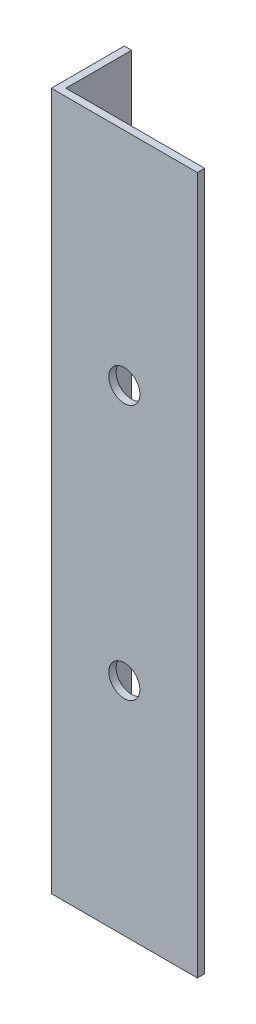
ISO-10303-21;
HEADER;
FILE_DESCRIPTION(('STEP AP214'),'2;1');
FILE_NAME('part.step','',(''),(''),'','','');
FILE_SCHEMA(('AUTOMOTIVE_DESIGN { 1 0 10303 214 1 1 1 1 }'));
ENDSEC;
DATA;
#1=APPLICATION_CONTEXT('core data for automotive mechanical design processes');
#2=APPLICATION_PROTOCOL_DEFINITION('international standard','automotive_design',2000,#1);
#3=PRODUCT_CONTEXT('',#1,'mechanical');
#4=PRODUCT('Part','Part','',(#3));
#5=PRODUCT_RELATED_PRODUCT_CATEGORY('part','',(#4));
#6=PRODUCT_DEFINITION_FORMATION('','',#4);
#7=PRODUCT_DEFINITION_CONTEXT('part definition',#1,'design');
#8=PRODUCT_DEFINITION('design','',#6,#7);
#9=PRODUCT_DEFINITION_SHAPE('','',#8);
#10=(LENGTH_UNIT() NAMED_UNIT(*) SI_UNIT(.MILLI.,.METRE.));
#11=(NAMED_UNIT(*) PLANE_ANGLE_UNIT() SI_UNIT($,.RADIAN.));
#12=(NAMED_UNIT(*) SI_UNIT($,.STERADIAN.) SOLID_ANGLE_UNIT());
#13=UNCERTAINTY_MEASURE_WITH_UNIT(LENGTH_MEASURE(1.E-05),#10,'distance_accuracy_value','');
#14=(GEOMETRIC_REPRESENTATION_CONTEXT(3) GLOBAL_UNCERTAINTY_ASSIGNED_CONTEXT((#13)) GLOBAL_UNIT_ASSIGNED_CONTEXT((#10,
#11,#12)) REPRESENTATION_CONTEXT('',''));
#15=CARTESIAN_POINT('',(0.,0.,0.));
#16=DIRECTION('',(0.,0.,1.));
#17=DIRECTION('',(1.,0.,0.));
#18=AXIS2_PLACEMENT_3D('',#15,#16,#17);
#19=CARTESIAN_POINT('',(40.,191.,0.));
#20=DIRECTION('',(0.,0.,-1.));
#21=DIRECTION('',(-1.,0.,0.));
#22=AXIS2_PLACEMENT_3D('',#19,#20,#21);
#23=PLANE('',#22);
#24=CARTESIAN_POINT('',(20.,60.5,0.));
#25=DIRECTION('',(0.,0.,1.));
#26=DIRECTION('',(1.,0.,0.));
#27=AXIS2_PLACEMENT_3D('',#24,#25,#26);
#28=CIRCLE('',#27,4.25000000000001);
#29=CARTESIAN_POINT('',(24.25,60.5,0.));
#30=VERTEX_POINT('',#29);
#31=EDGE_CURVE('E148',#30,#30,#28,.T.);
#32=ORIENTED_EDGE('',*,*,#31,.F.);
#33=EDGE_LOOP('',(#32));
#34=FACE_BOUND('',#33,.T.);
#35=CARTESIAN_POINT('',(20.,130.5,0.));
#36=DIRECTION('',(0.,0.,1.));
#37=DIRECTION('',(1.,0.,0.));
#38=AXIS2_PLACEMENT_3D('',#35,#36,#37);
#39=CIRCLE('',#38,4.25000000000001);
#40=CARTESIAN_POINT('',(24.25,130.5,0.));
#41=VERTEX_POINT('',#40);
#42=EDGE_CURVE('E140',#41,#41,#39,.T.);
#43=ORIENTED_EDGE('',*,*,#42,.F.);
#44=EDGE_LOOP('',(#43));
#45=FACE_BOUND('',#44,.T.);
#46=DIRECTION('',(1.,0.,0.));
#47=VECTOR('',#46,1.);
#48=CARTESIAN_POINT('',(40.,0.,0.));
#49=LINE('',#48,#47);
#50=CARTESIAN_POINT('',(0.,0.,0.));
#51=VERTEX_POINT('',#50);
#52=CARTESIAN_POINT('',(40.,0.,0.));
#53=VERTEX_POINT('',#52);
#54=EDGE_CURVE('E123',#51,#53,#49,.T.);
#55=ORIENTED_EDGE('',*,*,#54,.T.);
#56=DIRECTION('',(0.,-1.,0.));
#57=VECTOR('',#56,1.);
#58=CARTESIAN_POINT('',(40.,191.,0.));
#59=LINE('',#58,#57);
#60=CARTESIAN_POINT('',(40.,191.,0.));
#61=VERTEX_POINT('',#60);
#62=EDGE_CURVE('E11',#61,#53,#59,.T.);
#63=ORIENTED_EDGE('',*,*,#62,.F.);
#64=DIRECTION('',(1.,0.,0.));
#65=VECTOR('',#64,1.);
#66=CARTESIAN_POINT('',(40.,191.,0.));
#67=LINE('',#66,#65);
#68=CARTESIAN_POINT('',(0.,191.,0.));
#69=VERTEX_POINT('',#68);
#70=EDGE_CURVE('E134',#69,#61,#67,.T.);
#71=ORIENTED_EDGE('',*,*,#70,.F.);
#72=DIRECTION('',(0.,-1.,0.));
#73=VECTOR('',#72,1.);
#74=CARTESIAN_POINT('',(0.,191.,0.));
#75=LINE('',#74,#73);
#76=EDGE_CURVE('E119',#69,#51,#75,.T.);
#77=ORIENTED_EDGE('',*,*,#76,.T.);
#78=EDGE_LOOP('',(#55,#63,#71,#77));
#79=FACE_BOUND('',#78,.T.);
#80=ADVANCED_FACE('F37',(#34,#45,#79),#23,.F.);
#81=CARTESIAN_POINT('',(40.,191.,-2.));
#82=DIRECTION('',(-1.,0.,0.));
#83=DIRECTION('',(0.,0.,1.));
#84=AXIS2_PLACEMENT_3D('',#81,#82,#83);
#85=PLANE('',#84);
#86=DIRECTION('',(0.,0.,-1.));
#87=VECTOR('',#86,1.);
#88=CARTESIAN_POINT('',(40.,0.,-2.));
#89=LINE('',#88,#87);
#90=CARTESIAN_POINT('',(40.,0.,-2.));
#91=VERTEX_POINT('',#90);
#92=EDGE_CURVE('E126',#53,#91,#89,.T.);
#93=ORIENTED_EDGE('',*,*,#92,.T.);
#94=DIRECTION('',(0.,-1.,0.));
#95=VECTOR('',#94,1.);
#96=CARTESIAN_POINT('',(40.,191.,-2.));
#97=LINE('',#96,#95);
#98=CARTESIAN_POINT('',(40.,191.,-2.));
#99=VERTEX_POINT('',#98);
#100=EDGE_CURVE('E46',#99,#91,#97,.T.);
#101=ORIENTED_EDGE('',*,*,#100,.F.);
#102=DIRECTION('',(0.,0.,-1.));
#103=VECTOR('',#102,1.);
#104=CARTESIAN_POINT('',(40.,191.,-2.));
#105=LINE('',#104,#103);
#106=EDGE_CURVE('E92',#61,#99,#105,.T.);
#107=ORIENTED_EDGE('',*,*,#106,.F.);
#108=ORIENTED_EDGE('',*,*,#62,.T.);
#109=EDGE_LOOP('',(#93,#101,#107,#108));
#110=FACE_BOUND('',#109,.T.);
#111=ADVANCED_FACE('F155',(#110),#85,.F.);
#112=CARTESIAN_POINT('',(2.,191.,-2.));
#113=DIRECTION('',(0.,0.,1.));
#114=DIRECTION('',(1.,0.,0.));
#115=AXIS2_PLACEMENT_3D('',#112,#113,#114);
#116=PLANE('',#115);
#117=CARTESIAN_POINT('',(20.,60.5,-2.));
#118=DIRECTION('',(0.,0.,1.));
#119=DIRECTION('',(1.,0.,0.));
#120=AXIS2_PLACEMENT_3D('',#117,#118,#119);
#121=CIRCLE('',#120,4.25000000000001);
#122=CARTESIAN_POINT('',(24.25,60.5,-2.));
#123=VERTEX_POINT('',#122);
#124=EDGE_CURVE('E40',#123,#123,#121,.T.);
#125=ORIENTED_EDGE('',*,*,#124,.T.);
#126=EDGE_LOOP('',(#125));
#127=FACE_BOUND('',#126,.T.);
#128=CARTESIAN_POINT('',(20.,130.5,-2.));
#129=DIRECTION('',(0.,0.,1.));
#130=DIRECTION('',(1.,0.,0.));
#131=AXIS2_PLACEMENT_3D('',#128,#129,#130);
#132=CIRCLE('',#131,4.25000000000001);
#133=CARTESIAN_POINT('',(24.25,130.5,-2.));
#134=VERTEX_POINT('',#133);
#135=EDGE_CURVE('E127',#134,#134,#132,.T.);
#136=ORIENTED_EDGE('',*,*,#135,.T.);
#137=EDGE_LOOP('',(#136));
#138=FACE_BOUND('',#137,.T.);
#139=DIRECTION('',(-1.,0.,0.));
#140=VECTOR('',#139,1.);
#141=CARTESIAN_POINT('',(2.,0.,-2.));
#142=LINE('',#141,#140);
#143=CARTESIAN_POINT('',(2.,0.,-2.));
#144=VERTEX_POINT('',#143);
#145=EDGE_CURVE('E129',#91,#144,#142,.T.);
#146=ORIENTED_EDGE('',*,*,#145,.T.);
#147=DIRECTION('',(0.,-1.,0.));
#148=VECTOR('',#147,1.);
#149=CARTESIAN_POINT('',(2.,191.,-2.));
#150=LINE('',#149,#148);
#151=CARTESIAN_POINT('',(2.,191.,-2.));
#152=VERTEX_POINT('',#151);
#153=EDGE_CURVE('E114',#152,#144,#150,.T.);
#154=ORIENTED_EDGE('',*,*,#153,.F.);
#155=DIRECTION('',(-1.,0.,0.));
#156=VECTOR('',#155,1.);
#157=CARTESIAN_POINT('',(2.,191.,-2.));
#158=LINE('',#157,#156);
#159=EDGE_CURVE('E105',#99,#152,#158,.T.);
#160=ORIENTED_EDGE('',*,*,#159,.F.);
#161=ORIENTED_EDGE('',*,*,#100,.T.);
#162=EDGE_LOOP('',(#146,#154,#160,#161));
#163=FACE_BOUND('',#162,.T.);
#164=ADVANCED_FACE('F158',(#127,#138,#163),#116,.F.);
#165=CARTESIAN_POINT('',(2.,191.,-20.));
#166=DIRECTION('',(-1.,0.,0.));
#167=DIRECTION('',(0.,0.,1.));
#168=AXIS2_PLACEMENT_3D('',#165,#166,#167);
#169=PLANE('',#168);
#170=CARTESIAN_POINT('',(2.,179.000000000001,-9.99999999999905));
#171=DIRECTION('',(1.,0.,0.));
#172=DIRECTION('',(0.,0.,-1.));
#173=AXIS2_PLACEMENT_3D('',#170,#171,#172);
#174=CIRCLE('',#173,2.25);
#175=CARTESIAN_POINT('',(2.,179.000000000001,-12.249999999999));
#176=VERTEX_POINT('',#175);
#177=EDGE_CURVE('E195',#176,#176,#174,.T.);
#178=ORIENTED_EDGE('',*,*,#177,.F.);
#179=EDGE_LOOP('',(#178));
#180=FACE_BOUND('',#179,.T.);
#181=CARTESIAN_POINT('',(2.,12.0000000000008,-9.99999999999966));
#182=DIRECTION('',(1.,0.,0.));
#183=DIRECTION('',(0.,0.,-1.));
#184=AXIS2_PLACEMENT_3D('',#181,#182,#183);
#185=CIRCLE('',#184,2.25);
#186=CARTESIAN_POINT('',(2.,12.0000000000008,-12.2499999999997));
#187=VERTEX_POINT('',#186);
#188=EDGE_CURVE('E189',#187,#187,#185,.T.);
#189=ORIENTED_EDGE('',*,*,#188,.F.);
#190=EDGE_LOOP('',(#189));
#191=FACE_BOUND('',#190,.T.);
#192=DIRECTION('',(0.,0.,-1.));
#193=VECTOR('',#192,1.);
#194=CARTESIAN_POINT('',(2.,0.,-20.));
#195=LINE('',#194,#193);
#196=CARTESIAN_POINT('',(2.,0.,-20.));
#197=VERTEX_POINT('',#196);
#198=EDGE_CURVE('E113',#144,#197,#195,.T.);
#199=ORIENTED_EDGE('',*,*,#198,.T.);
#200=DIRECTION('',(0.,-1.,0.));
#201=VECTOR('',#200,1.);
#202=CARTESIAN_POINT('',(2.,191.,-20.));
#203=LINE('',#202,#201);
#204=CARTESIAN_POINT('',(2.,191.,-20.));
#205=VERTEX_POINT('',#204);
#206=EDGE_CURVE('E110',#205,#197,#203,.T.);
#207=ORIENTED_EDGE('',*,*,#206,.F.);
#208=DIRECTION('',(0.,0.,-1.));
#209=VECTOR('',#208,1.);
#210=CARTESIAN_POINT('',(2.,191.,-20.));
#211=LINE('',#210,#209);
#212=EDGE_CURVE('E99',#152,#205,#211,.T.);
#213=ORIENTED_EDGE('',*,*,#212,.F.);
#214=ORIENTED_EDGE('',*,*,#153,.T.);
#215=EDGE_LOOP('',(#199,#207,#213,#214));
#216=FACE_BOUND('',#215,.T.);
#217=ADVANCED_FACE('F111',(#180,#191,#216),#169,.F.);
#218=CARTESIAN_POINT('',(0.,191.,-20.));
#219=DIRECTION('',(0.,0.,1.));
#220=DIRECTION('',(1.,0.,0.));
#221=AXIS2_PLACEMENT_3D('',#218,#219,#220);
#222=PLANE('',#221);
#223=DIRECTION('',(-1.,0.,0.));
#224=VECTOR('',#223,1.);
#225=CARTESIAN_POINT('',(0.,0.,-20.));
#226=LINE('',#225,#224);
#227=CARTESIAN_POINT('',(0.,0.,-20.));
#228=VERTEX_POINT('',#227);
#229=EDGE_CURVE('E78',#197,#228,#226,.T.);
#230=ORIENTED_EDGE('',*,*,#229,.T.);
#231=DIRECTION('',(0.,-1.,0.));
#232=VECTOR('',#231,1.);
#233=CARTESIAN_POINT('',(0.,191.,-20.));
#234=LINE('',#233,#232);
#235=CARTESIAN_POINT('',(0.,191.,-20.));
#236=VERTEX_POINT('',#235);
#237=EDGE_CURVE('E115',#236,#228,#234,.T.);
#238=ORIENTED_EDGE('',*,*,#237,.F.);
#239=DIRECTION('',(-1.,0.,0.));
#240=VECTOR('',#239,1.);
#241=CARTESIAN_POINT('',(0.,191.,-20.));
#242=LINE('',#241,#240);
#243=EDGE_CURVE('E103',#205,#236,#242,.T.);
#244=ORIENTED_EDGE('',*,*,#243,.F.);
#245=ORIENTED_EDGE('',*,*,#206,.T.);
#246=EDGE_LOOP('',(#230,#238,#244,#245));
#247=FACE_BOUND('',#246,.T.);
#248=ADVANCED_FACE('F117',(#247),#222,.F.);
#249=CARTESIAN_POINT('',(0.,191.,0.));
#250=DIRECTION('',(1.,0.,0.));
#251=DIRECTION('',(0.,0.,-1.));
#252=AXIS2_PLACEMENT_3D('',#249,#250,#251);
#253=PLANE('',#252);
#254=CARTESIAN_POINT('',(0.,179.000000000001,-9.99999999999905));
#255=DIRECTION('',(1.,0.,0.));
#256=DIRECTION('',(0.,0.,-1.));
#257=AXIS2_PLACEMENT_3D('',#254,#255,#256);
#258=CIRCLE('',#257,2.25);
#259=CARTESIAN_POINT('',(0.,179.000000000001,-12.249999999999));
#260=VERTEX_POINT('',#259);
#261=EDGE_CURVE('E193',#260,#260,#258,.T.);
#262=ORIENTED_EDGE('',*,*,#261,.T.);
#263=EDGE_LOOP('',(#262));
#264=FACE_BOUND('',#263,.T.);
#265=CARTESIAN_POINT('',(0.,12.0000000000008,-9.99999999999966));
#266=DIRECTION('',(1.,0.,0.));
#267=DIRECTION('',(0.,0.,-1.));
#268=AXIS2_PLACEMENT_3D('',#265,#266,#267);
#269=CIRCLE('',#268,2.25);
#270=CARTESIAN_POINT('',(0.,12.0000000000008,-12.2499999999997));
#271=VERTEX_POINT('',#270);
#272=EDGE_CURVE('E187',#271,#271,#269,.T.);
#273=ORIENTED_EDGE('',*,*,#272,.T.);
#274=EDGE_LOOP('',(#273));
#275=FACE_BOUND('',#274,.T.);
#276=DIRECTION('',(0.,0.,1.));
#277=VECTOR('',#276,1.);
#278=CARTESIAN_POINT('',(0.,0.,0.));
#279=LINE('',#278,#277);
#280=EDGE_CURVE('E84',#228,#51,#279,.T.);
#281=ORIENTED_EDGE('',*,*,#280,.T.);
#282=ORIENTED_EDGE('',*,*,#76,.F.);
#283=DIRECTION('',(0.,0.,1.));
#284=VECTOR('',#283,1.);
#285=CARTESIAN_POINT('',(0.,191.,0.));
#286=LINE('',#285,#284);
#287=EDGE_CURVE('E55',#236,#69,#286,.T.);
#288=ORIENTED_EDGE('',*,*,#287,.F.);
#289=ORIENTED_EDGE('',*,*,#237,.T.);
#290=EDGE_LOOP('',(#281,#282,#288,#289));
#291=FACE_BOUND('',#290,.T.);
#292=ADVANCED_FACE('F163',(#264,#275,#291),#253,.F.);
#293=CARTESIAN_POINT('',(0.,191.,0.));
#294=DIRECTION('',(0.,-1.,0.));
#295=DIRECTION('',(0.,0.,-1.));
#296=AXIS2_PLACEMENT_3D('',#293,#294,#295);
#297=PLANE('',#296);
#298=ORIENTED_EDGE('',*,*,#70,.T.);
#299=ORIENTED_EDGE('',*,*,#106,.T.);
#300=ORIENTED_EDGE('',*,*,#159,.T.);
#301=ORIENTED_EDGE('',*,*,#212,.T.);
#302=ORIENTED_EDGE('',*,*,#243,.T.);
#303=ORIENTED_EDGE('',*,*,#287,.T.);
#304=EDGE_LOOP('',(#298,#299,#300,#301,#302,#303));
#305=FACE_BOUND('',#304,.T.);
#306=ADVANCED_FACE('F101',(#305),#297,.F.);
#307=CARTESIAN_POINT('',(0.,0.,0.));
#308=DIRECTION('',(0.,-1.,0.));
#309=DIRECTION('',(0.,0.,-1.));
#310=AXIS2_PLACEMENT_3D('',#307,#308,#309);
#311=PLANE('',#310);
#312=ORIENTED_EDGE('',*,*,#54,.F.);
#313=ORIENTED_EDGE('',*,*,#280,.F.);
#314=ORIENTED_EDGE('',*,*,#229,.F.);
#315=ORIENTED_EDGE('',*,*,#198,.F.);
#316=ORIENTED_EDGE('',*,*,#145,.F.);
#317=ORIENTED_EDGE('',*,*,#92,.F.);
#318=EDGE_LOOP('',(#312,#313,#314,#315,#316,#317));
#319=FACE_BOUND('',#318,.T.);
#320=ADVANCED_FACE('F161',(#319),#311,.T.);
#321=CARTESIAN_POINT('',(20.,130.5,-20.));
#322=DIRECTION('',(0.,0.,1.));
#323=DIRECTION('',(1.,0.,0.));
#324=AXIS2_PLACEMENT_3D('',#321,#322,#323);
#325=CYLINDRICAL_SURFACE('',#324,4.25000000000001);
#326=ORIENTED_EDGE('',*,*,#42,.T.);
#327=EDGE_LOOP('',(#326));
#328=FACE_BOUND('',#327,.T.);
#329=ORIENTED_EDGE('',*,*,#135,.F.);
#330=EDGE_LOOP('',(#329));
#331=FACE_BOUND('',#330,.T.);
#332=ADVANCED_FACE('F217',(#328,#331),#325,.F.);
#333=CARTESIAN_POINT('',(20.,60.5,-20.));
#334=DIRECTION('',(0.,0.,1.));
#335=DIRECTION('',(1.,0.,0.));
#336=AXIS2_PLACEMENT_3D('',#333,#334,#335);
#337=CYLINDRICAL_SURFACE('',#336,4.25000000000001);
#338=ORIENTED_EDGE('',*,*,#31,.T.);
#339=EDGE_LOOP('',(#338));
#340=FACE_BOUND('',#339,.T.);
#341=ORIENTED_EDGE('',*,*,#124,.F.);
#342=EDGE_LOOP('',(#341));
#343=FACE_BOUND('',#342,.T.);
#344=ADVANCED_FACE('F212',(#340,#343),#337,.F.);
#345=CARTESIAN_POINT('',(0.,12.0000000000008,-9.99999999999966));
#346=DIRECTION('',(1.,0.,0.));
#347=DIRECTION('',(0.,0.,-1.));
#348=AXIS2_PLACEMENT_3D('',#345,#346,#347);
#349=CYLINDRICAL_SURFACE('',#348,2.25);
#350=ORIENTED_EDGE('',*,*,#272,.F.);
#351=EDGE_LOOP('',(#350));
#352=FACE_BOUND('',#351,.T.);
#353=ORIENTED_EDGE('',*,*,#188,.T.);
#354=EDGE_LOOP('',(#353));
#355=FACE_BOUND('',#354,.T.);
#356=ADVANCED_FACE('F203',(#352,#355),#349,.F.);
#357=CARTESIAN_POINT('',(0.,179.000000000001,-9.99999999999905));
#358=DIRECTION('',(1.,0.,0.));
#359=DIRECTION('',(0.,0.,-1.));
#360=AXIS2_PLACEMENT_3D('',#357,#358,#359);
#361=CYLINDRICAL_SURFACE('',#360,2.25);
#362=ORIENTED_EDGE('',*,*,#261,.F.);
#363=EDGE_LOOP('',(#362));
#364=FACE_BOUND('',#363,.T.);
#365=ORIENTED_EDGE('',*,*,#177,.T.);
#366=EDGE_LOOP('',(#365));
#367=FACE_BOUND('',#366,.T.);
#368=ADVANCED_FACE('F200',(#364,#367),#361,.F.);
#369=CLOSED_SHELL('',(#80,#111,#164,#217,#248,#292,#306,#320,#332,#344,#356,#368));
#370=MANIFOLD_SOLID_BREP('B2',#369);
#371=ADVANCED_BREP_SHAPE_REPRESENTATION('',(#18,#370),#14);
#372=SHAPE_DEFINITION_REPRESENTATION(#9,#371);
ENDSEC;
END-ISO-10303-21;
